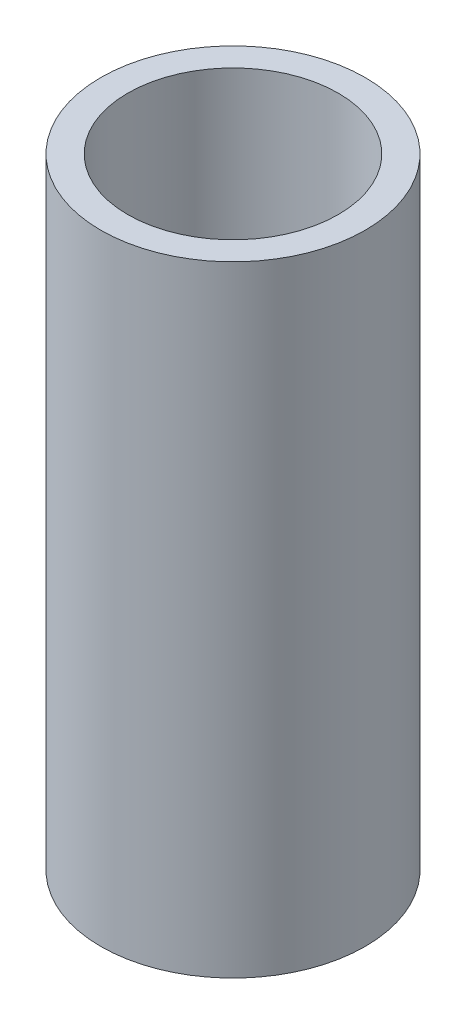
ISO-10303-21;
HEADER;
FILE_DESCRIPTION(('STEP AP214'),'2;1');
FILE_NAME('part.step','',(''),(''),'','','');
FILE_SCHEMA(('AUTOMOTIVE_DESIGN { 1 0 10303 214 1 1 1 1 }'));
ENDSEC;
DATA;
#1=APPLICATION_CONTEXT('core data for automotive mechanical design processes');
#2=APPLICATION_PROTOCOL_DEFINITION('international standard','automotive_design',2000,#1);
#3=PRODUCT_CONTEXT('',#1,'mechanical');
#4=PRODUCT('Part','Part','',(#3));
#5=PRODUCT_RELATED_PRODUCT_CATEGORY('part','',(#4));
#6=PRODUCT_DEFINITION_FORMATION('','',#4);
#7=PRODUCT_DEFINITION_CONTEXT('part definition',#1,'design');
#8=PRODUCT_DEFINITION('design','',#6,#7);
#9=PRODUCT_DEFINITION_SHAPE('','',#8);
#10=(LENGTH_UNIT() NAMED_UNIT(*) SI_UNIT(.MILLI.,.METRE.));
#11=(NAMED_UNIT(*) PLANE_ANGLE_UNIT() SI_UNIT($,.RADIAN.));
#12=(NAMED_UNIT(*) SI_UNIT($,.STERADIAN.) SOLID_ANGLE_UNIT());
#13=UNCERTAINTY_MEASURE_WITH_UNIT(LENGTH_MEASURE(1.E-05),#10,'distance_accuracy_value','');
#14=(GEOMETRIC_REPRESENTATION_CONTEXT(3) GLOBAL_UNCERTAINTY_ASSIGNED_CONTEXT((#13)) GLOBAL_UNIT_ASSIGNED_CONTEXT((#10,
#11,#12)) REPRESENTATION_CONTEXT('',''));
#15=CARTESIAN_POINT('',(0.,0.,0.));
#16=DIRECTION('',(0.,0.,1.));
#17=DIRECTION('',(1.,0.,0.));
#18=AXIS2_PLACEMENT_3D('',#15,#16,#17);
#19=CARTESIAN_POINT('',(0.,93.8157985685527,0.));
#20=DIRECTION('',(0.,-1.,0.));
#21=DIRECTION('',(0.,0.,-1.));
#22=AXIS2_PLACEMENT_3D('',#19,#20,#21);
#23=CYLINDRICAL_SURFACE('',#22,20.);
#24=CARTESIAN_POINT('',(0.,93.8157985685527,0.));
#25=DIRECTION('',(0.,1.,0.));
#26=DIRECTION('',(0.,0.,1.));
#27=AXIS2_PLACEMENT_3D('',#24,#25,#26);
#28=CIRCLE('',#27,20.);
#29=CARTESIAN_POINT('',(0.,93.8157985685527,20.));
#30=VERTEX_POINT('',#29);
#31=EDGE_CURVE('E10',#30,#30,#28,.T.);
#32=ORIENTED_EDGE('',*,*,#31,.F.);
#33=EDGE_LOOP('',(#32));
#34=FACE_BOUND('',#33,.T.);
#35=CARTESIAN_POINT('',(0.,0.,0.));
#36=DIRECTION('',(0.,1.,0.));
#37=DIRECTION('',(0.,0.,1.));
#38=AXIS2_PLACEMENT_3D('',#35,#36,#37);
#39=CIRCLE('',#38,20.);
#40=CARTESIAN_POINT('',(0.,0.,20.));
#41=VERTEX_POINT('',#40);
#42=EDGE_CURVE('E37',#41,#41,#39,.T.);
#43=ORIENTED_EDGE('',*,*,#42,.T.);
#44=EDGE_LOOP('',(#43));
#45=FACE_BOUND('',#44,.T.);
#46=ADVANCED_FACE('F40',(#34,#45),#23,.T.);
#47=CARTESIAN_POINT('',(0.,93.8157985685527,0.));
#48=DIRECTION('',(0.,1.,0.));
#49=DIRECTION('',(0.,0.,1.));
#50=AXIS2_PLACEMENT_3D('',#47,#48,#49);
#51=PLANE('',#50);
#52=CARTESIAN_POINT('',(0.,93.8157985685527,0.));
#53=DIRECTION('',(0.,1.,0.));
#54=DIRECTION('',(0.,0.,1.));
#55=AXIS2_PLACEMENT_3D('',#52,#53,#54);
#56=CIRCLE('',#55,15.9182133542101);
#57=CARTESIAN_POINT('',(0.,93.8157985685527,15.9182133542101));
#58=VERTEX_POINT('',#57);
#59=EDGE_CURVE('E50',#58,#58,#56,.T.);
#60=ORIENTED_EDGE('',*,*,#59,.F.);
#61=EDGE_LOOP('',(#60));
#62=FACE_BOUND('',#61,.T.);
#63=ORIENTED_EDGE('',*,*,#31,.T.);
#64=EDGE_LOOP('',(#63));
#65=FACE_BOUND('',#64,.T.);
#66=ADVANCED_FACE('F59',(#62,#65),#51,.T.);
#67=CARTESIAN_POINT('',(0.,0.,0.));
#68=DIRECTION('',(0.,1.,0.));
#69=DIRECTION('',(0.,0.,1.));
#70=AXIS2_PLACEMENT_3D('',#67,#68,#69);
#71=PLANE('',#70);
#72=CARTESIAN_POINT('',(0.,0.,0.));
#73=DIRECTION('',(0.,1.,0.));
#74=DIRECTION('',(0.,0.,1.));
#75=AXIS2_PLACEMENT_3D('',#72,#73,#74);
#76=CIRCLE('',#75,15.9182133542101);
#77=CARTESIAN_POINT('',(0.,0.,15.9182133542101));
#78=VERTEX_POINT('',#77);
#79=EDGE_CURVE('E47',#78,#78,#76,.T.);
#80=ORIENTED_EDGE('',*,*,#79,.T.);
#81=EDGE_LOOP('',(#80));
#82=FACE_BOUND('',#81,.T.);
#83=ORIENTED_EDGE('',*,*,#42,.F.);
#84=EDGE_LOOP('',(#83));
#85=FACE_BOUND('',#84,.T.);
#86=ADVANCED_FACE('F58',(#82,#85),#71,.F.);
#87=CARTESIAN_POINT('',(0.,93.8157985685527,0.));
#88=DIRECTION('',(0.,-1.,0.));
#89=DIRECTION('',(0.,0.,-1.));
#90=AXIS2_PLACEMENT_3D('',#87,#88,#89);
#91=CYLINDRICAL_SURFACE('',#90,15.9182133542101);
#92=ORIENTED_EDGE('',*,*,#59,.T.);
#93=EDGE_LOOP('',(#92));
#94=FACE_BOUND('',#93,.T.);
#95=ORIENTED_EDGE('',*,*,#79,.F.);
#96=EDGE_LOOP('',(#95));
#97=FACE_BOUND('',#96,.T.);
#98=ADVANCED_FACE('F54',(#94,#97),#91,.F.);
#99=CLOSED_SHELL('',(#46,#66,#86,#98));
#100=MANIFOLD_SOLID_BREP('B2',#99);
#101=ADVANCED_BREP_SHAPE_REPRESENTATION('',(#18,#100),#14);
#102=SHAPE_DEFINITION_REPRESENTATION(#9,#101);
ENDSEC;
END-ISO-10303-21;
